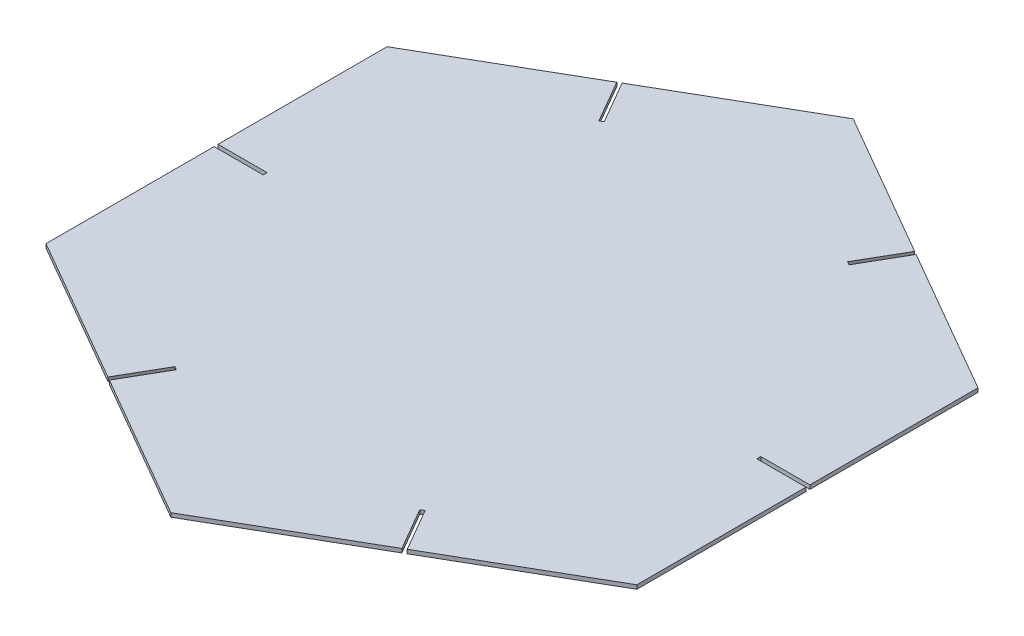
ISO-10303-21;
HEADER;
FILE_DESCRIPTION(('STEP AP214'),'2;1');
FILE_NAME('part.step','',(''),(''),'','','');
FILE_SCHEMA(('AUTOMOTIVE_DESIGN { 1 0 10303 214 1 1 1 1 }'));
ENDSEC;
DATA;
#1=APPLICATION_CONTEXT('core data for automotive mechanical design processes');
#2=APPLICATION_PROTOCOL_DEFINITION('international standard','automotive_design',2000,#1);
#3=PRODUCT_CONTEXT('',#1,'mechanical');
#4=PRODUCT('Part','Part','',(#3));
#5=PRODUCT_RELATED_PRODUCT_CATEGORY('part','',(#4));
#6=PRODUCT_DEFINITION_FORMATION('','',#4);
#7=PRODUCT_DEFINITION_CONTEXT('part definition',#1,'design');
#8=PRODUCT_DEFINITION('design','',#6,#7);
#9=PRODUCT_DEFINITION_SHAPE('','',#8);
#10=(LENGTH_UNIT() NAMED_UNIT(*) SI_UNIT(.MILLI.,.METRE.));
#11=(NAMED_UNIT(*) PLANE_ANGLE_UNIT() SI_UNIT($,.RADIAN.));
#12=(NAMED_UNIT(*) SI_UNIT($,.STERADIAN.) SOLID_ANGLE_UNIT());
#13=UNCERTAINTY_MEASURE_WITH_UNIT(LENGTH_MEASURE(1.E-05),#10,'distance_accuracy_value','');
#14=(GEOMETRIC_REPRESENTATION_CONTEXT(3) GLOBAL_UNCERTAINTY_ASSIGNED_CONTEXT((#13)) GLOBAL_UNIT_ASSIGNED_CONTEXT((#10,
#11,#12)) REPRESENTATION_CONTEXT('',''));
#15=CARTESIAN_POINT('',(0.,0.,0.));
#16=DIRECTION('',(0.,0.,1.));
#17=DIRECTION('',(1.,0.,0.));
#18=AXIS2_PLACEMENT_3D('',#15,#16,#17);
#19=CARTESIAN_POINT('',(60.1955721887819,0.8,-34.7539298072177));
#20=DIRECTION('',(-0.499999999999995,0.,0.866025403784442));
#21=DIRECTION('',(0.866025403784442,0.,0.499999999999995));
#22=AXIS2_PLACEMENT_3D('',#19,#20,#21);
#23=PLANE('',#22);
#24=DIRECTION('',(-0.866025403784442,0.,-0.499999999999995));
#25=VECTOR('',#24,1.);
#26=CARTESIAN_POINT('',(60.1955721887819,0.8,-34.7539298072177));
#27=LINE('',#26,#25);
#28=CARTESIAN_POINT('',(29.6647733924987,0.8,-52.3808947108252));
#29=VERTEX_POINT('',#28);
#30=CARTESIAN_POINT('',(0.,0.8,-69.507859614434));
#31=VERTEX_POINT('',#30);
#32=EDGE_CURVE('E312',#29,#31,#27,.T.);
#33=ORIENTED_EDGE('',*,*,#32,.F.);
#34=DIRECTION('',(0.,-1.,0.));
#35=VECTOR('',#34,1.);
#36=CARTESIAN_POINT('',(29.6647733924987,0.8,-52.3808947108252));
#37=LINE('',#36,#35);
#38=CARTESIAN_POINT('',(29.6647733924987,0.,-52.3808947108252));
#39=VERTEX_POINT('',#38);
#40=EDGE_CURVE('E479',#29,#39,#37,.T.);
#41=ORIENTED_EDGE('',*,*,#40,.T.);
#42=DIRECTION('',(-0.866025403784442,0.,-0.499999999999995));
#43=VECTOR('',#42,1.);
#44=CARTESIAN_POINT('',(60.1955721887819,0.,-34.7539298072177));
#45=LINE('',#44,#43);
#46=CARTESIAN_POINT('',(0.,0.,-69.507859614434));
#47=VERTEX_POINT('',#46);
#48=EDGE_CURVE('E290',#39,#47,#45,.T.);
#49=ORIENTED_EDGE('',*,*,#48,.T.);
#50=DIRECTION('',(0.,-1.,0.));
#51=VECTOR('',#50,1.);
#52=CARTESIAN_POINT('',(0.,0.8,-69.507859614434));
#53=LINE('',#52,#51);
#54=EDGE_CURVE('E11',#31,#47,#53,.T.);
#55=ORIENTED_EDGE('',*,*,#54,.F.);
#56=EDGE_LOOP('',(#33,#41,#49,#55));
#57=FACE_BOUND('',#56,.T.);
#58=ADVANCED_FACE('F41',(#57),#23,.F.);
#59=CARTESIAN_POINT('',(0.,0.8,-69.507859614434));
#60=DIRECTION('',(0.500000000000001,0.,0.866025403784438));
#61=DIRECTION('',(0.866025403784438,0.,-0.500000000000001));
#62=AXIS2_PLACEMENT_3D('',#59,#60,#61);
#63=PLANE('',#62);
#64=DIRECTION('',(-0.866025403784438,0.,0.500000000000001));
#65=VECTOR('',#64,1.);
#66=CARTESIAN_POINT('',(0.,0.8,-69.507859614434));
#67=LINE('',#66,#65);
#68=CARTESIAN_POINT('',(-30.5307987962831,0.8,-51.8808947108252));
#69=VERTEX_POINT('',#68);
#70=CARTESIAN_POINT('',(-60.1955721887824,0.8,-34.7539298072169));
#71=VERTEX_POINT('',#70);
#72=EDGE_CURVE('E410',#69,#71,#67,.T.);
#73=ORIENTED_EDGE('',*,*,#72,.F.);
#74=DIRECTION('',(0.,-1.,0.));
#75=VECTOR('',#74,1.);
#76=CARTESIAN_POINT('',(-30.5307987962831,0.8,-51.8808947108252));
#77=LINE('',#76,#75);
#78=CARTESIAN_POINT('',(-30.5307987962831,0.,-51.8808947108252));
#79=VERTEX_POINT('',#78);
#80=EDGE_CURVE('E473',#69,#79,#77,.T.);
#81=ORIENTED_EDGE('',*,*,#80,.T.);
#82=DIRECTION('',(-0.866025403784438,0.,0.500000000000001));
#83=VECTOR('',#82,1.);
#84=CARTESIAN_POINT('',(0.,0.,-69.507859614434));
#85=LINE('',#84,#83);
#86=CARTESIAN_POINT('',(-60.1955721887824,0.,-34.7539298072169));
#87=VERTEX_POINT('',#86);
#88=EDGE_CURVE('E289',#79,#87,#85,.T.);
#89=ORIENTED_EDGE('',*,*,#88,.T.);
#90=DIRECTION('',(0.,-1.,0.));
#91=VECTOR('',#90,1.);
#92=CARTESIAN_POINT('',(-60.1955721887824,0.8,-34.7539298072169));
#93=LINE('',#92,#91);
#94=EDGE_CURVE('E50',#71,#87,#93,.T.);
#95=ORIENTED_EDGE('',*,*,#94,.F.);
#96=EDGE_LOOP('',(#73,#81,#89,#95));
#97=FACE_BOUND('',#96,.T.);
#98=ADVANCED_FACE('F627',(#97),#63,.F.);
#99=CARTESIAN_POINT('',(-60.1955721887824,0.8,-34.7539298072169));
#100=DIRECTION('',(1.,0.,0.));
#101=DIRECTION('',(0.,0.,-1.));
#102=AXIS2_PLACEMENT_3D('',#99,#100,#101);
#103=PLANE('',#102);
#104=DIRECTION('',(0.,0.,1.));
#105=VECTOR('',#104,1.);
#106=CARTESIAN_POINT('',(-60.1955721887824,0.8,-34.7539298072169));
#107=LINE('',#106,#105);
#108=CARTESIAN_POINT('',(-60.1955721887819,0.8,0.499999999999985));
#109=VERTEX_POINT('',#108);
#110=CARTESIAN_POINT('',(-60.1955721887821,0.8,34.7539298072173));
#111=VERTEX_POINT('',#110);
#112=EDGE_CURVE('E415',#109,#111,#107,.T.);
#113=ORIENTED_EDGE('',*,*,#112,.F.);
#114=DIRECTION('',(0.,-1.,0.));
#115=VECTOR('',#114,1.);
#116=CARTESIAN_POINT('',(-60.1955721887819,0.8,0.499999999999985));
#117=LINE('',#116,#115);
#118=CARTESIAN_POINT('',(-60.1955721887819,0.,0.499999999999985));
#119=VERTEX_POINT('',#118);
#120=EDGE_CURVE('E361',#109,#119,#117,.T.);
#121=ORIENTED_EDGE('',*,*,#120,.T.);
#122=DIRECTION('',(0.,0.,1.));
#123=VECTOR('',#122,1.);
#124=CARTESIAN_POINT('',(-60.1955721887824,0.,-34.7539298072169));
#125=LINE('',#124,#123);
#126=CARTESIAN_POINT('',(-60.1955721887821,0.,34.7539298072173));
#127=VERTEX_POINT('',#126);
#128=EDGE_CURVE('E295',#119,#127,#125,.T.);
#129=ORIENTED_EDGE('',*,*,#128,.T.);
#130=DIRECTION('',(0.,-1.,0.));
#131=VECTOR('',#130,1.);
#132=CARTESIAN_POINT('',(-60.1955721887821,0.8,34.7539298072173));
#133=LINE('',#132,#131);
#134=EDGE_CURVE('E320',#111,#127,#133,.T.);
#135=ORIENTED_EDGE('',*,*,#134,.F.);
#136=EDGE_LOOP('',(#113,#121,#129,#135));
#137=FACE_BOUND('',#136,.T.);
#138=ADVANCED_FACE('F537',(#137),#103,.F.);
#139=CARTESIAN_POINT('',(-60.1955721887821,0.8,34.7539298072173));
#140=DIRECTION('',(0.499999999999995,0.,-0.866025403784442));
#141=DIRECTION('',(-0.866025403784442,0.,-0.499999999999995));
#142=AXIS2_PLACEMENT_3D('',#139,#140,#141);
#143=PLANE('',#142);
#144=DIRECTION('',(0.866025403784442,0.,0.499999999999995));
#145=VECTOR('',#144,1.);
#146=CARTESIAN_POINT('',(-60.1955721887821,0.8,34.7539298072173));
#147=LINE('',#146,#145);
#148=CARTESIAN_POINT('',(-29.6647733924988,0.8,52.3808947108251));
#149=VERTEX_POINT('',#148);
#150=CARTESIAN_POINT('',(4.85370789493449E-13,0.8,69.507859614434));
#151=VERTEX_POINT('',#150);
#152=EDGE_CURVE('E417',#149,#151,#147,.T.);
#153=ORIENTED_EDGE('',*,*,#152,.F.);
#154=DIRECTION('',(0.,-1.,0.));
#155=VECTOR('',#154,1.);
#156=CARTESIAN_POINT('',(-29.6647733924988,0.8,52.3808947108251));
#157=LINE('',#156,#155);
#158=CARTESIAN_POINT('',(-29.6647733924988,0.,52.3808947108251));
#159=VERTEX_POINT('',#158);
#160=EDGE_CURVE('E345',#149,#159,#157,.T.);
#161=ORIENTED_EDGE('',*,*,#160,.T.);
#162=DIRECTION('',(0.866025403784442,0.,0.499999999999995));
#163=VECTOR('',#162,1.);
#164=CARTESIAN_POINT('',(-60.1955721887821,0.,34.7539298072173));
#165=LINE('',#164,#163);
#166=CARTESIAN_POINT('',(4.85370789493449E-13,0.,69.507859614434));
#167=VERTEX_POINT('',#166);
#168=EDGE_CURVE('E300',#159,#167,#165,.T.);
#169=ORIENTED_EDGE('',*,*,#168,.T.);
#170=DIRECTION('',(0.,-1.,0.));
#171=VECTOR('',#170,1.);
#172=CARTESIAN_POINT('',(4.85370789493449E-13,0.8,69.507859614434));
#173=LINE('',#172,#171);
#174=EDGE_CURVE('E316',#151,#167,#173,.T.);
#175=ORIENTED_EDGE('',*,*,#174,.F.);
#176=EDGE_LOOP('',(#153,#161,#169,#175));
#177=FACE_BOUND('',#176,.T.);
#178=ADVANCED_FACE('F431',(#177),#143,.F.);
#179=CARTESIAN_POINT('',(4.85370789493449E-13,0.8,69.507859614434));
#180=DIRECTION('',(-0.500000000000007,0.,-0.866025403784435));
#181=DIRECTION('',(-0.866025403784435,0.,0.500000000000007));
#182=AXIS2_PLACEMENT_3D('',#179,#180,#181);
#183=PLANE('',#182);
#184=DIRECTION('',(0.866025403784435,0.,-0.500000000000007));
#185=VECTOR('',#184,1.);
#186=CARTESIAN_POINT('',(4.85370789493449E-13,0.8,69.507859614434));
#187=LINE('',#186,#185);
#188=CARTESIAN_POINT('',(30.5307987962831,0.8,51.8808947108252));
#189=VERTEX_POINT('',#188);
#190=CARTESIAN_POINT('',(60.1955721887826,0.8,34.7539298072165));
#191=VERTEX_POINT('',#190);
#192=EDGE_CURVE('E270',#189,#191,#187,.T.);
#193=ORIENTED_EDGE('',*,*,#192,.F.);
#194=DIRECTION('',(0.,-1.,0.));
#195=VECTOR('',#194,1.);
#196=CARTESIAN_POINT('',(30.5307987962831,0.8,51.8808947108252));
#197=LINE('',#196,#195);
#198=CARTESIAN_POINT('',(30.5307987962831,0.,51.8808947108252));
#199=VERTEX_POINT('',#198);
#200=EDGE_CURVE('E393',#189,#199,#197,.T.);
#201=ORIENTED_EDGE('',*,*,#200,.T.);
#202=DIRECTION('',(0.866025403784435,0.,-0.500000000000007));
#203=VECTOR('',#202,1.);
#204=CARTESIAN_POINT('',(4.85370789493449E-13,0.,69.507859614434));
#205=LINE('',#204,#203);
#206=CARTESIAN_POINT('',(60.1955721887826,0.,34.7539298072165));
#207=VERTEX_POINT('',#206);
#208=EDGE_CURVE('E305',#199,#207,#205,.T.);
#209=ORIENTED_EDGE('',*,*,#208,.T.);
#210=DIRECTION('',(0.,-1.,0.));
#211=VECTOR('',#210,1.);
#212=CARTESIAN_POINT('',(60.1955721887826,0.8,34.7539298072165));
#213=LINE('',#212,#211);
#214=EDGE_CURVE('E279',#191,#207,#213,.T.);
#215=ORIENTED_EDGE('',*,*,#214,.F.);
#216=EDGE_LOOP('',(#193,#201,#209,#215));
#217=FACE_BOUND('',#216,.T.);
#218=ADVANCED_FACE('F600',(#217),#183,.F.);
#219=CARTESIAN_POINT('',(60.1955721887826,0.8,34.7539298072165));
#220=DIRECTION('',(-1.,0.,0.));
#221=DIRECTION('',(0.,0.,1.));
#222=AXIS2_PLACEMENT_3D('',#219,#220,#221);
#223=PLANE('',#222);
#224=DIRECTION('',(0.,0.,-1.));
#225=VECTOR('',#224,1.);
#226=CARTESIAN_POINT('',(60.1955721887826,0.8,34.7539298072165));
#227=LINE('',#226,#225);
#228=CARTESIAN_POINT('',(60.1955721887819,0.8,-0.5));
#229=VERTEX_POINT('',#228);
#230=CARTESIAN_POINT('',(60.1955721887819,0.8,-34.7539298072177));
#231=VERTEX_POINT('',#230);
#232=EDGE_CURVE('E274',#229,#231,#227,.T.);
#233=ORIENTED_EDGE('',*,*,#232,.F.);
#234=DIRECTION('',(0.,-1.,0.));
#235=VECTOR('',#234,1.);
#236=CARTESIAN_POINT('',(60.1955721887819,0.8,-0.5));
#237=LINE('',#236,#235);
#238=CARTESIAN_POINT('',(60.1955721887819,0.,-0.5));
#239=VERTEX_POINT('',#238);
#240=EDGE_CURVE('E549',#229,#239,#237,.T.);
#241=ORIENTED_EDGE('',*,*,#240,.T.);
#242=DIRECTION('',(0.,0.,-1.));
#243=VECTOR('',#242,1.);
#244=CARTESIAN_POINT('',(60.1955721887826,0.,34.7539298072165));
#245=LINE('',#244,#243);
#246=CARTESIAN_POINT('',(60.1955721887819,0.,-34.7539298072177));
#247=VERTEX_POINT('',#246);
#248=EDGE_CURVE('E310',#239,#247,#245,.T.);
#249=ORIENTED_EDGE('',*,*,#248,.T.);
#250=DIRECTION('',(0.,-1.,0.));
#251=VECTOR('',#250,1.);
#252=CARTESIAN_POINT('',(60.1955721887819,0.8,-34.7539298072177));
#253=LINE('',#252,#251);
#254=EDGE_CURVE('E273',#231,#247,#253,.T.);
#255=ORIENTED_EDGE('',*,*,#254,.F.);
#256=EDGE_LOOP('',(#233,#241,#249,#255));
#257=FACE_BOUND('',#256,.T.);
#258=ADVANCED_FACE('F634',(#257),#223,.F.);
#259=CARTESIAN_POINT('',(30.3575937155266,0.,-51.9808947108257));
#260=VERTEX_POINT('',#259);
#261=EDGE_CURVE('E285',#247,#260,#45,.T.);
#262=ORIENTED_EDGE('',*,*,#261,.T.);
#263=DIRECTION('',(0.,-1.,0.));
#264=VECTOR('',#263,1.);
#265=CARTESIAN_POINT('',(30.3575937155263,0.8,-51.9808947108252));
#266=LINE('',#265,#264);
#267=CARTESIAN_POINT('',(30.3575937155263,0.8,-51.9808947108252));
#268=VERTEX_POINT('',#267);
#269=EDGE_CURVE('E467',#268,#260,#266,.T.);
#270=ORIENTED_EDGE('',*,*,#269,.F.);
#271=EDGE_CURVE('E406',#231,#268,#27,.T.);
#272=ORIENTED_EDGE('',*,*,#271,.F.);
#273=ORIENTED_EDGE('',*,*,#254,.T.);
#274=EDGE_LOOP('',(#262,#270,#272,#273));
#275=FACE_BOUND('',#274,.T.);
#276=ADVANCED_FACE('F43',(#275),#23,.F.);
#277=CARTESIAN_POINT('',(-29.8379784732558,0.,-52.2808947108255));
#278=VERTEX_POINT('',#277);
#279=EDGE_CURVE('E291',#47,#278,#85,.T.);
#280=ORIENTED_EDGE('',*,*,#279,.T.);
#281=DIRECTION('',(0.,-1.,0.));
#282=VECTOR('',#281,1.);
#283=CARTESIAN_POINT('',(-29.8379784732556,0.8,-52.2808947108252));
#284=LINE('',#283,#282);
#285=CARTESIAN_POINT('',(-29.8379784732556,0.8,-52.2808947108252));
#286=VERTEX_POINT('',#285);
#287=EDGE_CURVE('E57',#286,#278,#284,.T.);
#288=ORIENTED_EDGE('',*,*,#287,.F.);
#289=EDGE_CURVE('E411',#31,#286,#67,.T.);
#290=ORIENTED_EDGE('',*,*,#289,.F.);
#291=ORIENTED_EDGE('',*,*,#54,.T.);
#292=EDGE_LOOP('',(#280,#288,#290,#291));
#293=FACE_BOUND('',#292,.T.);
#294=ADVANCED_FACE('F623',(#293),#63,.F.);
#295=CARTESIAN_POINT('',(-60.1955721887823,0.,-0.300000000000016));
#296=VERTEX_POINT('',#295);
#297=EDGE_CURVE('E296',#87,#296,#125,.T.);
#298=ORIENTED_EDGE('',*,*,#297,.T.);
#299=DIRECTION('',(0.,-1.,0.));
#300=VECTOR('',#299,1.);
#301=CARTESIAN_POINT('',(-60.1955721887819,0.8,-0.300000000000015));
#302=LINE('',#301,#300);
#303=CARTESIAN_POINT('',(-60.1955721887819,0.8,-0.300000000000015));
#304=VERTEX_POINT('',#303);
#305=EDGE_CURVE('E65',#304,#296,#302,.T.);
#306=ORIENTED_EDGE('',*,*,#305,.F.);
#307=EDGE_CURVE('E331',#71,#304,#107,.T.);
#308=ORIENTED_EDGE('',*,*,#307,.F.);
#309=ORIENTED_EDGE('',*,*,#94,.T.);
#310=EDGE_LOOP('',(#298,#306,#308,#309));
#311=FACE_BOUND('',#310,.T.);
#312=ADVANCED_FACE('F329',(#311),#103,.F.);
#313=CARTESIAN_POINT('',(-30.3575937155265,0.,51.9808947108255));
#314=VERTEX_POINT('',#313);
#315=EDGE_CURVE('E301',#127,#314,#165,.T.);
#316=ORIENTED_EDGE('',*,*,#315,.T.);
#317=DIRECTION('',(0.,-1.,0.));
#318=VECTOR('',#317,1.);
#319=CARTESIAN_POINT('',(-30.3575937155263,0.8,51.9808947108251));
#320=LINE('',#319,#318);
#321=CARTESIAN_POINT('',(-30.3575937155263,0.8,51.9808947108251));
#322=VERTEX_POINT('',#321);
#323=EDGE_CURVE('E387',#322,#314,#320,.T.);
#324=ORIENTED_EDGE('',*,*,#323,.F.);
#325=EDGE_CURVE('E418',#111,#322,#147,.T.);
#326=ORIENTED_EDGE('',*,*,#325,.F.);
#327=ORIENTED_EDGE('',*,*,#134,.T.);
#328=EDGE_LOOP('',(#316,#324,#326,#327));
#329=FACE_BOUND('',#328,.T.);
#330=ADVANCED_FACE('F615',(#329),#143,.F.);
#331=CARTESIAN_POINT('',(29.8379784732558,0.,52.2808947108255));
#332=VERTEX_POINT('',#331);
#333=EDGE_CURVE('E306',#167,#332,#205,.T.);
#334=ORIENTED_EDGE('',*,*,#333,.T.);
#335=DIRECTION('',(0.,-1.,0.));
#336=VECTOR('',#335,1.);
#337=CARTESIAN_POINT('',(29.8379784732556,0.8,52.2808947108252));
#338=LINE('',#337,#336);
#339=CARTESIAN_POINT('',(29.8379784732556,0.8,52.2808947108252));
#340=VERTEX_POINT('',#339);
#341=EDGE_CURVE('E437',#340,#332,#338,.T.);
#342=ORIENTED_EDGE('',*,*,#341,.F.);
#343=EDGE_CURVE('E281',#151,#340,#187,.T.);
#344=ORIENTED_EDGE('',*,*,#343,.F.);
#345=ORIENTED_EDGE('',*,*,#174,.T.);
#346=EDGE_LOOP('',(#334,#342,#344,#345));
#347=FACE_BOUND('',#346,.T.);
#348=ADVANCED_FACE('F436',(#347),#183,.F.);
#349=CARTESIAN_POINT('',(60.1955721887823,0.,0.300000000000002));
#350=VERTEX_POINT('',#349);
#351=EDGE_CURVE('E262',#207,#350,#245,.T.);
#352=ORIENTED_EDGE('',*,*,#351,.T.);
#353=DIRECTION('',(0.,-1.,0.));
#354=VECTOR('',#353,1.);
#355=CARTESIAN_POINT('',(60.1955721887819,0.8,0.3));
#356=LINE('',#355,#354);
#357=CARTESIAN_POINT('',(60.1955721887819,0.8,0.3));
#358=VERTEX_POINT('',#357);
#359=EDGE_CURVE('E244',#358,#350,#356,.T.);
#360=ORIENTED_EDGE('',*,*,#359,.F.);
#361=EDGE_CURVE('E260',#191,#358,#227,.T.);
#362=ORIENTED_EDGE('',*,*,#361,.F.);
#363=ORIENTED_EDGE('',*,*,#214,.T.);
#364=EDGE_LOOP('',(#352,#360,#362,#363));
#365=FACE_BOUND('',#364,.T.);
#366=ADVANCED_FACE('F258',(#365),#223,.F.);
#367=CARTESIAN_POINT('',(0.,0.8,0.));
#368=DIRECTION('',(0.,1.,0.));
#369=DIRECTION('',(0.,0.,1.));
#370=AXIS2_PLACEMENT_3D('',#367,#368,#369);
#371=PLANE('',#370);
#372=DIRECTION('',(1.,0.,0.));
#373=VECTOR('',#372,1.);
#374=CARTESIAN_POINT('',(60.1955721887819,0.8,-0.5));
#375=LINE('',#374,#373);
#376=CARTESIAN_POINT('',(50.1955721887819,0.8,-0.500000000000001));
#377=VERTEX_POINT('',#376);
#378=EDGE_CURVE('E264',#377,#229,#375,.T.);
#379=ORIENTED_EDGE('',*,*,#378,.T.);
#380=ORIENTED_EDGE('',*,*,#232,.T.);
#381=ORIENTED_EDGE('',*,*,#271,.T.);
#382=DIRECTION('',(-0.5,0.,0.866025403784439));
#383=VECTOR('',#382,1.);
#384=CARTESIAN_POINT('',(30.3575937155263,0.8,-51.9808947108252));
#385=LINE('',#384,#383);
#386=CARTESIAN_POINT('',(25.3575937155263,0.8,-43.3206406729808));
#387=VERTEX_POINT('',#386);
#388=EDGE_CURVE('E454',#268,#387,#385,.T.);
#389=ORIENTED_EDGE('',*,*,#388,.T.);
#390=DIRECTION('',(-0.86602540378444,0.,-0.499999999999999));
#391=VECTOR('',#390,1.);
#392=CARTESIAN_POINT('',(24.6647733924987,0.8,-43.7206406729808));
#393=LINE('',#392,#391);
#394=CARTESIAN_POINT('',(24.6647733924987,0.8,-43.7206406729808));
#395=VERTEX_POINT('',#394);
#396=EDGE_CURVE('E458',#387,#395,#393,.T.);
#397=ORIENTED_EDGE('',*,*,#396,.T.);
#398=DIRECTION('',(0.5,0.,-0.866025403784439));
#399=VECTOR('',#398,1.);
#400=CARTESIAN_POINT('',(29.6647733924987,0.8,-52.3808947108252));
#401=LINE('',#400,#399);
#402=EDGE_CURVE('E463',#395,#29,#401,.T.);
#403=ORIENTED_EDGE('',*,*,#402,.T.);
#404=ORIENTED_EDGE('',*,*,#32,.T.);
#405=ORIENTED_EDGE('',*,*,#289,.T.);
#406=DIRECTION('',(0.499999999999999,0.,0.866025403784439));
#407=VECTOR('',#406,1.);
#408=CARTESIAN_POINT('',(-29.8379784732556,0.8,-52.2808947108252));
#409=LINE('',#408,#407);
#410=CARTESIAN_POINT('',(-24.8379784732556,0.8,-43.6206406729808));
#411=VERTEX_POINT('',#410);
#412=EDGE_CURVE('E492',#286,#411,#409,.T.);
#413=ORIENTED_EDGE('',*,*,#412,.T.);
#414=DIRECTION('',(-0.866025403784437,0.,0.500000000000002));
#415=VECTOR('',#414,1.);
#416=CARTESIAN_POINT('',(-25.5307987962831,0.8,-43.2206406729808));
#417=LINE('',#416,#415);
#418=CARTESIAN_POINT('',(-25.5307987962831,0.8,-43.2206406729808));
#419=VERTEX_POINT('',#418);
#420=EDGE_CURVE('E496',#411,#419,#417,.T.);
#421=ORIENTED_EDGE('',*,*,#420,.T.);
#422=DIRECTION('',(-0.5,0.,-0.866025403784439));
#423=VECTOR('',#422,1.);
#424=CARTESIAN_POINT('',(-30.5307987962831,0.8,-51.8808947108252));
#425=LINE('',#424,#423);
#426=EDGE_CURVE('E501',#419,#69,#425,.T.);
#427=ORIENTED_EDGE('',*,*,#426,.T.);
#428=ORIENTED_EDGE('',*,*,#72,.T.);
#429=ORIENTED_EDGE('',*,*,#307,.T.);
#430=DIRECTION('',(1.,0.,0.));
#431=VECTOR('',#430,1.);
#432=CARTESIAN_POINT('',(-60.1955721887819,0.8,-0.300000000000015));
#433=LINE('',#432,#431);
#434=CARTESIAN_POINT('',(-50.1955721887819,0.8,-0.300000000000013));
#435=VERTEX_POINT('',#434);
#436=EDGE_CURVE('E360',#304,#435,#433,.T.);
#437=ORIENTED_EDGE('',*,*,#436,.T.);
#438=DIRECTION('',(0.,0.,1.));
#439=VECTOR('',#438,1.);
#440=CARTESIAN_POINT('',(-50.1955721887819,0.8,0.499999999999987));
#441=LINE('',#440,#439);
#442=CARTESIAN_POINT('',(-50.1955721887819,0.8,0.499999999999987));
#443=VERTEX_POINT('',#442);
#444=EDGE_CURVE('E526',#435,#443,#441,.T.);
#445=ORIENTED_EDGE('',*,*,#444,.T.);
#446=DIRECTION('',(-1.,0.,0.));
#447=VECTOR('',#446,1.);
#448=CARTESIAN_POINT('',(-60.1955721887819,0.8,0.499999999999985));
#449=LINE('',#448,#447);
#450=EDGE_CURVE('E355',#443,#109,#449,.T.);
#451=ORIENTED_EDGE('',*,*,#450,.T.);
#452=ORIENTED_EDGE('',*,*,#112,.T.);
#453=ORIENTED_EDGE('',*,*,#325,.T.);
#454=DIRECTION('',(0.500000000000001,0.,-0.866025403784438));
#455=VECTOR('',#454,1.);
#456=CARTESIAN_POINT('',(-30.3575937155263,0.8,51.9808947108251));
#457=LINE('',#456,#455);
#458=CARTESIAN_POINT('',(-25.3575937155263,0.8,43.3206406729808));
#459=VERTEX_POINT('',#458);
#460=EDGE_CURVE('E374',#322,#459,#457,.T.);
#461=ORIENTED_EDGE('',*,*,#460,.T.);
#462=DIRECTION('',(0.866025403784438,0.,0.5));
#463=VECTOR('',#462,1.);
#464=CARTESIAN_POINT('',(-24.6647733924988,0.8,43.7206406729808));
#465=LINE('',#464,#463);
#466=CARTESIAN_POINT('',(-24.6647733924988,0.8,43.7206406729808));
#467=VERTEX_POINT('',#466);
#468=EDGE_CURVE('E378',#459,#467,#465,.T.);
#469=ORIENTED_EDGE('',*,*,#468,.T.);
#470=DIRECTION('',(-0.5,0.,0.866025403784439));
#471=VECTOR('',#470,1.);
#472=CARTESIAN_POINT('',(-29.6647733924988,0.8,52.3808947108251));
#473=LINE('',#472,#471);
#474=EDGE_CURVE('E383',#467,#149,#473,.T.);
#475=ORIENTED_EDGE('',*,*,#474,.T.);
#476=ORIENTED_EDGE('',*,*,#152,.T.);
#477=ORIENTED_EDGE('',*,*,#343,.T.);
#478=DIRECTION('',(-0.499999999999999,0.,-0.866025403784439));
#479=VECTOR('',#478,1.);
#480=CARTESIAN_POINT('',(29.8379784732556,0.8,52.2808947108252));
#481=LINE('',#480,#479);
#482=CARTESIAN_POINT('',(24.8379784732556,0.8,43.6206406729808));
#483=VERTEX_POINT('',#482);
#484=EDGE_CURVE('E571',#340,#483,#481,.T.);
#485=ORIENTED_EDGE('',*,*,#484,.T.);
#486=DIRECTION('',(0.86602540378444,0.,-0.499999999999999));
#487=VECTOR('',#486,1.);
#488=CARTESIAN_POINT('',(25.5307987962831,0.8,43.2206406729808));
#489=LINE('',#488,#487);
#490=CARTESIAN_POINT('',(25.5307987962831,0.8,43.2206406729808));
#491=VERTEX_POINT('',#490);
#492=EDGE_CURVE('E450',#483,#491,#489,.T.);
#493=ORIENTED_EDGE('',*,*,#492,.T.);
#494=DIRECTION('',(0.5,0.,0.866025403784439));
#495=VECTOR('',#494,1.);
#496=CARTESIAN_POINT('',(30.5307987962831,0.8,51.8808947108252));
#497=LINE('',#496,#495);
#498=EDGE_CURVE('E444',#491,#189,#497,.T.);
#499=ORIENTED_EDGE('',*,*,#498,.T.);
#500=ORIENTED_EDGE('',*,*,#192,.T.);
#501=ORIENTED_EDGE('',*,*,#361,.T.);
#502=DIRECTION('',(-1.,0.,0.));
#503=VECTOR('',#502,1.);
#504=CARTESIAN_POINT('',(60.1955721887819,0.8,0.3));
#505=LINE('',#504,#503);
#506=CARTESIAN_POINT('',(50.1955721887819,0.8,0.299999999999999));
#507=VERTEX_POINT('',#506);
#508=EDGE_CURVE('E240',#358,#507,#505,.T.);
#509=ORIENTED_EDGE('',*,*,#508,.T.);
#510=DIRECTION('',(0.,0.,-1.));
#511=VECTOR('',#510,1.);
#512=CARTESIAN_POINT('',(50.1955721887819,0.8,-0.500000000000001));
#513=LINE('',#512,#511);
#514=EDGE_CURVE('E252',#507,#377,#513,.T.);
#515=ORIENTED_EDGE('',*,*,#514,.T.);
#516=EDGE_LOOP('',(#379,#380,#381,#389,#397,#403,#404,#405,#413,#421,#427,#428,#429,#437,#445,
#451,#452,#453,#461,#469,#475,#476,#477,#485,#493,#499,#500,#501,#509,#515));
#517=FACE_BOUND('',#516,.T.);
#518=ADVANCED_FACE('F267',(#517),#371,.T.);
#519=CARTESIAN_POINT('',(0.,0.,0.));
#520=DIRECTION('',(0.,1.,0.));
#521=DIRECTION('',(0.,0.,1.));
#522=AXIS2_PLACEMENT_3D('',#519,#520,#521);
#523=PLANE('',#522);
#524=ORIENTED_EDGE('',*,*,#248,.F.);
#525=DIRECTION('',(1.,0.,0.));
#526=VECTOR('',#525,1.);
#527=CARTESIAN_POINT('',(60.1955721887819,0.,-0.5));
#528=LINE('',#527,#526);
#529=CARTESIAN_POINT('',(50.1955721887819,0.,-0.500000000000001));
#530=VERTEX_POINT('',#529);
#531=EDGE_CURVE('E253',#530,#239,#528,.T.);
#532=ORIENTED_EDGE('',*,*,#531,.F.);
#533=DIRECTION('',(0.,0.,-1.));
#534=VECTOR('',#533,1.);
#535=CARTESIAN_POINT('',(50.1955721887819,0.,-0.500000000000001));
#536=LINE('',#535,#534);
#537=CARTESIAN_POINT('',(50.1955721887819,0.,0.299999999999999));
#538=VERTEX_POINT('',#537);
#539=EDGE_CURVE('E563',#538,#530,#536,.T.);
#540=ORIENTED_EDGE('',*,*,#539,.F.);
#541=DIRECTION('',(-1.,0.,0.));
#542=VECTOR('',#541,1.);
#543=CARTESIAN_POINT('',(60.1955721887819,0.,0.3));
#544=LINE('',#543,#542);
#545=EDGE_CURVE('E483',#350,#538,#544,.T.);
#546=ORIENTED_EDGE('',*,*,#545,.F.);
#547=ORIENTED_EDGE('',*,*,#351,.F.);
#548=ORIENTED_EDGE('',*,*,#208,.F.);
#549=DIRECTION('',(0.5,0.,0.866025403784439));
#550=VECTOR('',#549,1.);
#551=CARTESIAN_POINT('',(30.5307987962831,0.,51.8808947108252));
#552=LINE('',#551,#550);
#553=CARTESIAN_POINT('',(25.5307987962831,0.,43.2206406729808));
#554=VERTEX_POINT('',#553);
#555=EDGE_CURVE('E574',#554,#199,#552,.T.);
#556=ORIENTED_EDGE('',*,*,#555,.F.);
#557=DIRECTION('',(0.86602540378444,0.,-0.499999999999999));
#558=VECTOR('',#557,1.);
#559=CARTESIAN_POINT('',(25.5307987962831,0.,43.2206406729808));
#560=LINE('',#559,#558);
#561=CARTESIAN_POINT('',(24.8379784732556,0.,43.6206406729808));
#562=VERTEX_POINT('',#561);
#563=EDGE_CURVE('E581',#562,#554,#560,.T.);
#564=ORIENTED_EDGE('',*,*,#563,.F.);
#565=DIRECTION('',(-0.499999999999999,0.,-0.866025403784439));
#566=VECTOR('',#565,1.);
#567=CARTESIAN_POINT('',(29.8379784732556,0.,52.2808947108252));
#568=LINE('',#567,#566);
#569=EDGE_CURVE('E578',#332,#562,#568,.T.);
#570=ORIENTED_EDGE('',*,*,#569,.F.);
#571=ORIENTED_EDGE('',*,*,#333,.F.);
#572=ORIENTED_EDGE('',*,*,#168,.F.);
#573=DIRECTION('',(-0.5,0.,0.866025403784439));
#574=VECTOR('',#573,1.);
#575=CARTESIAN_POINT('',(-29.6647733924988,0.,52.3808947108251));
#576=LINE('',#575,#574);
#577=CARTESIAN_POINT('',(-24.6647733924988,0.,43.7206406729808));
#578=VERTEX_POINT('',#577);
#579=EDGE_CURVE('E379',#578,#159,#576,.T.);
#580=ORIENTED_EDGE('',*,*,#579,.F.);
#581=DIRECTION('',(0.866025403784438,0.,0.5));
#582=VECTOR('',#581,1.);
#583=CARTESIAN_POINT('',(-24.6647733924988,0.,43.7206406729808));
#584=LINE('',#583,#582);
#585=CARTESIAN_POINT('',(-25.3575937155263,0.,43.3206406729808));
#586=VERTEX_POINT('',#585);
#587=EDGE_CURVE('E392',#586,#578,#584,.T.);
#588=ORIENTED_EDGE('',*,*,#587,.F.);
#589=DIRECTION('',(0.500000000000001,0.,-0.866025403784438));
#590=VECTOR('',#589,1.);
#591=CARTESIAN_POINT('',(-30.3575937155263,0.,51.9808947108251));
#592=LINE('',#591,#590);
#593=EDGE_CURVE('E388',#314,#586,#592,.T.);
#594=ORIENTED_EDGE('',*,*,#593,.F.);
#595=ORIENTED_EDGE('',*,*,#315,.F.);
#596=ORIENTED_EDGE('',*,*,#128,.F.);
#597=DIRECTION('',(-1.,0.,0.));
#598=VECTOR('',#597,1.);
#599=CARTESIAN_POINT('',(-60.1955721887819,0.,0.499999999999985));
#600=LINE('',#599,#598);
#601=CARTESIAN_POINT('',(-50.1955721887819,0.,0.499999999999987));
#602=VERTEX_POINT('',#601);
#603=EDGE_CURVE('E349',#602,#119,#600,.T.);
#604=ORIENTED_EDGE('',*,*,#603,.F.);
#605=DIRECTION('',(0.,0.,1.));
#606=VECTOR('',#605,1.);
#607=CARTESIAN_POINT('',(-50.1955721887819,0.,0.499999999999987));
#608=LINE('',#607,#606);
#609=CARTESIAN_POINT('',(-50.1955721887819,0.,-0.300000000000013));
#610=VERTEX_POINT('',#609);
#611=EDGE_CURVE('E343',#610,#602,#608,.T.);
#612=ORIENTED_EDGE('',*,*,#611,.F.);
#613=DIRECTION('',(1.,0.,0.));
#614=VECTOR('',#613,1.);
#615=CARTESIAN_POINT('',(-60.1955721887819,0.,-0.300000000000015));
#616=LINE('',#615,#614);
#617=EDGE_CURVE('E340',#296,#610,#616,.T.);
#618=ORIENTED_EDGE('',*,*,#617,.F.);
#619=ORIENTED_EDGE('',*,*,#297,.F.);
#620=ORIENTED_EDGE('',*,*,#88,.F.);
#621=DIRECTION('',(-0.5,0.,-0.866025403784439));
#622=VECTOR('',#621,1.);
#623=CARTESIAN_POINT('',(-30.5307987962831,0.,-51.8808947108252));
#624=LINE('',#623,#622);
#625=CARTESIAN_POINT('',(-25.5307987962831,0.,-43.2206406729808));
#626=VERTEX_POINT('',#625);
#627=EDGE_CURVE('E497',#626,#79,#624,.T.);
#628=ORIENTED_EDGE('',*,*,#627,.F.);
#629=DIRECTION('',(-0.866025403784437,0.,0.500000000000002));
#630=VECTOR('',#629,1.);
#631=CARTESIAN_POINT('',(-25.5307987962831,0.,-43.2206406729808));
#632=LINE('',#631,#630);
#633=CARTESIAN_POINT('',(-24.8379784732556,0.,-43.6206406729808));
#634=VERTEX_POINT('',#633);
#635=EDGE_CURVE('E507',#634,#626,#632,.T.);
#636=ORIENTED_EDGE('',*,*,#635,.F.);
#637=DIRECTION('',(0.499999999999999,0.,0.866025403784439));
#638=VECTOR('',#637,1.);
#639=CARTESIAN_POINT('',(-29.8379784732556,0.,-52.2808947108252));
#640=LINE('',#639,#638);
#641=EDGE_CURVE('E365',#278,#634,#640,.T.);
#642=ORIENTED_EDGE('',*,*,#641,.F.);
#643=ORIENTED_EDGE('',*,*,#279,.F.);
#644=ORIENTED_EDGE('',*,*,#48,.F.);
#645=DIRECTION('',(0.5,0.,-0.866025403784439));
#646=VECTOR('',#645,1.);
#647=CARTESIAN_POINT('',(29.6647733924987,0.,-52.3808947108252));
#648=LINE('',#647,#646);
#649=CARTESIAN_POINT('',(24.6647733924987,0.,-43.7206406729808));
#650=VERTEX_POINT('',#649);
#651=EDGE_CURVE('E459',#650,#39,#648,.T.);
#652=ORIENTED_EDGE('',*,*,#651,.F.);
#653=DIRECTION('',(-0.86602540378444,0.,-0.499999999999999));
#654=VECTOR('',#653,1.);
#655=CARTESIAN_POINT('',(24.6647733924987,0.,-43.7206406729808));
#656=LINE('',#655,#654);
#657=CARTESIAN_POINT('',(25.3575937155263,0.,-43.3206406729808));
#658=VERTEX_POINT('',#657);
#659=EDGE_CURVE('E472',#658,#650,#656,.T.);
#660=ORIENTED_EDGE('',*,*,#659,.F.);
#661=DIRECTION('',(-0.5,0.,0.866025403784439));
#662=VECTOR('',#661,1.);
#663=CARTESIAN_POINT('',(30.3575937155263,0.,-51.9808947108252));
#664=LINE('',#663,#662);
#665=EDGE_CURVE('E468',#260,#658,#664,.T.);
#666=ORIENTED_EDGE('',*,*,#665,.F.);
#667=ORIENTED_EDGE('',*,*,#261,.F.);
#668=EDGE_LOOP('',(#524,#532,#540,#546,#547,#548,#556,#564,#570,#571,#572,#580,#588,#594,#595,
#596,#604,#612,#618,#619,#620,#628,#636,#642,#643,#644,#652,#660,#666,#667));
#669=FACE_BOUND('',#668,.T.);
#670=ADVANCED_FACE('F337',(#669),#523,.F.);
#671=CARTESIAN_POINT('',(29.6647733924987,0.8,-52.3808947108252));
#672=DIRECTION('',(-0.866025403784439,0.,-0.5));
#673=DIRECTION('',(-0.5,0.,0.866025403784439));
#674=AXIS2_PLACEMENT_3D('',#671,#672,#673);
#675=PLANE('',#674);
#676=ORIENTED_EDGE('',*,*,#651,.T.);
#677=ORIENTED_EDGE('',*,*,#40,.F.);
#678=ORIENTED_EDGE('',*,*,#402,.F.);
#679=DIRECTION('',(0.,-1.,0.));
#680=VECTOR('',#679,1.);
#681=CARTESIAN_POINT('',(24.6647733924987,0.8,-43.7206406729808));
#682=LINE('',#681,#680);
#683=EDGE_CURVE('E484',#395,#650,#682,.T.);
#684=ORIENTED_EDGE('',*,*,#683,.T.);
#685=EDGE_LOOP('',(#676,#677,#678,#684));
#686=FACE_BOUND('',#685,.T.);
#687=ADVANCED_FACE('F675',(#686),#675,.F.);
#688=CARTESIAN_POINT('',(24.6647733924987,0.8,-43.7206406729808));
#689=DIRECTION('',(-0.499999999999999,0.,0.866025403784439));
#690=DIRECTION('',(0.866025403784439,0.,0.499999999999999));
#691=AXIS2_PLACEMENT_3D('',#688,#689,#690);
#692=PLANE('',#691);
#693=ORIENTED_EDGE('',*,*,#659,.T.);
#694=ORIENTED_EDGE('',*,*,#683,.F.);
#695=ORIENTED_EDGE('',*,*,#396,.F.);
#696=DIRECTION('',(0.,-1.,0.));
#697=VECTOR('',#696,1.);
#698=CARTESIAN_POINT('',(25.3575937155263,0.8,-43.3206406729808));
#699=LINE('',#698,#697);
#700=EDGE_CURVE('E487',#387,#658,#699,.T.);
#701=ORIENTED_EDGE('',*,*,#700,.T.);
#702=EDGE_LOOP('',(#693,#694,#695,#701));
#703=FACE_BOUND('',#702,.T.);
#704=ADVANCED_FACE('F678',(#703),#692,.F.);
#705=CARTESIAN_POINT('',(30.3575937155263,0.8,-51.9808947108252));
#706=DIRECTION('',(0.866025403784439,0.,0.5));
#707=DIRECTION('',(0.5,0.,-0.866025403784439));
#708=AXIS2_PLACEMENT_3D('',#705,#706,#707);
#709=PLANE('',#708);
#710=ORIENTED_EDGE('',*,*,#665,.T.);
#711=ORIENTED_EDGE('',*,*,#700,.F.);
#712=ORIENTED_EDGE('',*,*,#388,.F.);
#713=ORIENTED_EDGE('',*,*,#269,.T.);
#714=EDGE_LOOP('',(#710,#711,#712,#713));
#715=FACE_BOUND('',#714,.T.);
#716=ADVANCED_FACE('F652',(#715),#709,.F.);
#717=CARTESIAN_POINT('',(-30.5307987962831,0.8,-51.8808947108252));
#718=DIRECTION('',(-0.866025403784439,0.,0.5));
#719=DIRECTION('',(0.5,0.,0.866025403784439));
#720=AXIS2_PLACEMENT_3D('',#717,#718,#719);
#721=PLANE('',#720);
#722=ORIENTED_EDGE('',*,*,#627,.T.);
#723=ORIENTED_EDGE('',*,*,#80,.F.);
#724=ORIENTED_EDGE('',*,*,#426,.F.);
#725=DIRECTION('',(0.,-1.,0.));
#726=VECTOR('',#725,1.);
#727=CARTESIAN_POINT('',(-25.5307987962831,0.8,-43.2206406729808));
#728=LINE('',#727,#726);
#729=EDGE_CURVE('E516',#419,#626,#728,.T.);
#730=ORIENTED_EDGE('',*,*,#729,.T.);
#731=EDGE_LOOP('',(#722,#723,#724,#730));
#732=FACE_BOUND('',#731,.T.);
#733=ADVANCED_FACE('F685',(#732),#721,.F.);
#734=CARTESIAN_POINT('',(-25.5307987962831,0.8,-43.2206406729808));
#735=DIRECTION('',(0.500000000000002,0.,0.866025403784437));
#736=DIRECTION('',(0.866025403784437,0.,-0.500000000000002));
#737=AXIS2_PLACEMENT_3D('',#734,#735,#736);
#738=PLANE('',#737);
#739=ORIENTED_EDGE('',*,*,#635,.T.);
#740=ORIENTED_EDGE('',*,*,#729,.F.);
#741=ORIENTED_EDGE('',*,*,#420,.F.);
#742=DIRECTION('',(0.,-1.,0.));
#743=VECTOR('',#742,1.);
#744=CARTESIAN_POINT('',(-24.8379784732556,0.8,-43.6206406729808));
#745=LINE('',#744,#743);
#746=EDGE_CURVE('E519',#411,#634,#745,.T.);
#747=ORIENTED_EDGE('',*,*,#746,.T.);
#748=EDGE_LOOP('',(#739,#740,#741,#747));
#749=FACE_BOUND('',#748,.T.);
#750=ADVANCED_FACE('F688',(#749),#738,.F.);
#751=CARTESIAN_POINT('',(-29.8379784732556,0.8,-52.2808947108252));
#752=DIRECTION('',(0.866025403784439,0.,-0.499999999999999));
#753=DIRECTION('',(-0.499999999999999,0.,-0.866025403784439));
#754=AXIS2_PLACEMENT_3D('',#751,#752,#753);
#755=PLANE('',#754);
#756=ORIENTED_EDGE('',*,*,#641,.T.);
#757=ORIENTED_EDGE('',*,*,#746,.F.);
#758=ORIENTED_EDGE('',*,*,#412,.F.);
#759=ORIENTED_EDGE('',*,*,#287,.T.);
#760=EDGE_LOOP('',(#756,#757,#758,#759));
#761=FACE_BOUND('',#760,.T.);
#762=ADVANCED_FACE('F692',(#761),#755,.F.);
#763=CARTESIAN_POINT('',(-60.1955721887819,0.8,0.499999999999985));
#764=DIRECTION('',(0.,0.,1.));
#765=DIRECTION('',(1.,0.,0.));
#766=AXIS2_PLACEMENT_3D('',#763,#764,#765);
#767=PLANE('',#766);
#768=ORIENTED_EDGE('',*,*,#603,.T.);
#769=ORIENTED_EDGE('',*,*,#120,.F.);
#770=ORIENTED_EDGE('',*,*,#450,.F.);
#771=DIRECTION('',(0.,-1.,0.));
#772=VECTOR('',#771,1.);
#773=CARTESIAN_POINT('',(-50.1955721887819,0.8,0.499999999999987));
#774=LINE('',#773,#772);
#775=EDGE_CURVE('E366',#443,#602,#774,.T.);
#776=ORIENTED_EDGE('',*,*,#775,.T.);
#777=EDGE_LOOP('',(#768,#769,#770,#776));
#778=FACE_BOUND('',#777,.T.);
#779=ADVANCED_FACE('F696',(#778),#767,.F.);
#780=CARTESIAN_POINT('',(-50.1955721887819,0.8,0.499999999999987));
#781=DIRECTION('',(1.,0.,0.));
#782=DIRECTION('',(0.,0.,-1.));
#783=AXIS2_PLACEMENT_3D('',#780,#781,#782);
#784=PLANE('',#783);
#785=ORIENTED_EDGE('',*,*,#611,.T.);
#786=ORIENTED_EDGE('',*,*,#775,.F.);
#787=ORIENTED_EDGE('',*,*,#444,.F.);
#788=DIRECTION('',(0.,-1.,0.));
#789=VECTOR('',#788,1.);
#790=CARTESIAN_POINT('',(-50.1955721887819,0.8,-0.300000000000013));
#791=LINE('',#790,#789);
#792=EDGE_CURVE('E369',#435,#610,#791,.T.);
#793=ORIENTED_EDGE('',*,*,#792,.T.);
#794=EDGE_LOOP('',(#785,#786,#787,#793));
#795=FACE_BOUND('',#794,.T.);
#796=ADVANCED_FACE('F699',(#795),#784,.F.);
#797=CARTESIAN_POINT('',(-60.1955721887819,0.8,-0.300000000000015));
#798=DIRECTION('',(0.,0.,-1.));
#799=DIRECTION('',(-1.,0.,0.));
#800=AXIS2_PLACEMENT_3D('',#797,#798,#799);
#801=PLANE('',#800);
#802=ORIENTED_EDGE('',*,*,#617,.T.);
#803=ORIENTED_EDGE('',*,*,#792,.F.);
#804=ORIENTED_EDGE('',*,*,#436,.F.);
#805=ORIENTED_EDGE('',*,*,#305,.T.);
#806=EDGE_LOOP('',(#802,#803,#804,#805));
#807=FACE_BOUND('',#806,.T.);
#808=ADVANCED_FACE('F702',(#807),#801,.F.);
#809=CARTESIAN_POINT('',(-29.6647733924988,0.8,52.3808947108251));
#810=DIRECTION('',(0.866025403784439,0.,0.5));
#811=DIRECTION('',(0.5,0.,-0.866025403784439));
#812=AXIS2_PLACEMENT_3D('',#809,#810,#811);
#813=PLANE('',#812);
#814=ORIENTED_EDGE('',*,*,#579,.T.);
#815=ORIENTED_EDGE('',*,*,#160,.F.);
#816=ORIENTED_EDGE('',*,*,#474,.F.);
#817=DIRECTION('',(0.,-1.,0.));
#818=VECTOR('',#817,1.);
#819=CARTESIAN_POINT('',(-24.6647733924988,0.8,43.7206406729808));
#820=LINE('',#819,#818);
#821=EDGE_CURVE('E352',#467,#578,#820,.T.);
#822=ORIENTED_EDGE('',*,*,#821,.T.);
#823=EDGE_LOOP('',(#814,#815,#816,#822));
#824=FACE_BOUND('',#823,.T.);
#825=ADVANCED_FACE('F606',(#824),#813,.F.);
#826=CARTESIAN_POINT('',(-24.6647733924988,0.8,43.7206406729808));
#827=DIRECTION('',(0.5,0.,-0.866025403784438));
#828=DIRECTION('',(-0.866025403784438,0.,-0.5));
#829=AXIS2_PLACEMENT_3D('',#826,#827,#828);
#830=PLANE('',#829);
#831=ORIENTED_EDGE('',*,*,#587,.T.);
#832=ORIENTED_EDGE('',*,*,#821,.F.);
#833=ORIENTED_EDGE('',*,*,#468,.F.);
#834=DIRECTION('',(0.,-1.,0.));
#835=VECTOR('',#834,1.);
#836=CARTESIAN_POINT('',(-25.3575937155263,0.8,43.3206406729808));
#837=LINE('',#836,#835);
#838=EDGE_CURVE('E401',#459,#586,#837,.T.);
#839=ORIENTED_EDGE('',*,*,#838,.T.);
#840=EDGE_LOOP('',(#831,#832,#833,#839));
#841=FACE_BOUND('',#840,.T.);
#842=ADVANCED_FACE('F609',(#841),#830,.F.);
#843=CARTESIAN_POINT('',(-30.3575937155263,0.8,51.9808947108251));
#844=DIRECTION('',(-0.866025403784438,0.,-0.500000000000001));
#845=DIRECTION('',(-0.500000000000001,0.,0.866025403784438));
#846=AXIS2_PLACEMENT_3D('',#843,#844,#845);
#847=PLANE('',#846);
#848=ORIENTED_EDGE('',*,*,#593,.T.);
#849=ORIENTED_EDGE('',*,*,#838,.F.);
#850=ORIENTED_EDGE('',*,*,#460,.F.);
#851=ORIENTED_EDGE('',*,*,#323,.T.);
#852=EDGE_LOOP('',(#848,#849,#850,#851));
#853=FACE_BOUND('',#852,.T.);
#854=ADVANCED_FACE('F611',(#853),#847,.F.);
#855=CARTESIAN_POINT('',(30.5307987962831,0.8,51.8808947108252));
#856=DIRECTION('',(0.866025403784439,0.,-0.5));
#857=DIRECTION('',(-0.5,0.,-0.866025403784439));
#858=AXIS2_PLACEMENT_3D('',#855,#856,#857);
#859=PLANE('',#858);
#860=ORIENTED_EDGE('',*,*,#555,.T.);
#861=ORIENTED_EDGE('',*,*,#200,.F.);
#862=ORIENTED_EDGE('',*,*,#498,.F.);
#863=DIRECTION('',(0.,-1.,0.));
#864=VECTOR('',#863,1.);
#865=CARTESIAN_POINT('',(25.5307987962831,0.8,43.2206406729808));
#866=LINE('',#865,#864);
#867=EDGE_CURVE('E448',#491,#554,#866,.T.);
#868=ORIENTED_EDGE('',*,*,#867,.T.);
#869=EDGE_LOOP('',(#860,#861,#862,#868));
#870=FACE_BOUND('',#869,.T.);
#871=ADVANCED_FACE('F592',(#870),#859,.F.);
#872=CARTESIAN_POINT('',(25.5307987962831,0.8,43.2206406729808));
#873=DIRECTION('',(-0.499999999999999,0.,-0.866025403784439));
#874=DIRECTION('',(-0.866025403784439,0.,0.499999999999999));
#875=AXIS2_PLACEMENT_3D('',#872,#873,#874);
#876=PLANE('',#875);
#877=ORIENTED_EDGE('',*,*,#563,.T.);
#878=ORIENTED_EDGE('',*,*,#867,.F.);
#879=ORIENTED_EDGE('',*,*,#492,.F.);
#880=DIRECTION('',(0.,-1.,0.));
#881=VECTOR('',#880,1.);
#882=CARTESIAN_POINT('',(24.8379784732556,0.8,43.6206406729808));
#883=LINE('',#882,#881);
#884=EDGE_CURVE('E443',#483,#562,#883,.T.);
#885=ORIENTED_EDGE('',*,*,#884,.T.);
#886=EDGE_LOOP('',(#877,#878,#879,#885));
#887=FACE_BOUND('',#886,.T.);
#888=ADVANCED_FACE('F597',(#887),#876,.F.);
#889=CARTESIAN_POINT('',(29.8379784732556,0.8,52.2808947108252));
#890=DIRECTION('',(-0.866025403784439,0.,0.499999999999999));
#891=DIRECTION('',(0.499999999999999,0.,0.866025403784439));
#892=AXIS2_PLACEMENT_3D('',#889,#890,#891);
#893=PLANE('',#892);
#894=ORIENTED_EDGE('',*,*,#569,.T.);
#895=ORIENTED_EDGE('',*,*,#884,.F.);
#896=ORIENTED_EDGE('',*,*,#484,.F.);
#897=ORIENTED_EDGE('',*,*,#341,.T.);
#898=EDGE_LOOP('',(#894,#895,#896,#897));
#899=FACE_BOUND('',#898,.T.);
#900=ADVANCED_FACE('F601',(#899),#893,.F.);
#901=CARTESIAN_POINT('',(60.1955721887819,0.8,-0.5));
#902=DIRECTION('',(0.,0.,-1.));
#903=DIRECTION('',(-1.,0.,0.));
#904=AXIS2_PLACEMENT_3D('',#901,#902,#903);
#905=PLANE('',#904);
#906=ORIENTED_EDGE('',*,*,#531,.T.);
#907=ORIENTED_EDGE('',*,*,#240,.F.);
#908=ORIENTED_EDGE('',*,*,#378,.F.);
#909=DIRECTION('',(0.,-1.,0.));
#910=VECTOR('',#909,1.);
#911=CARTESIAN_POINT('',(50.1955721887819,0.8,-0.500000000000001));
#912=LINE('',#911,#910);
#913=EDGE_CURVE('E552',#377,#530,#912,.T.);
#914=ORIENTED_EDGE('',*,*,#913,.T.);
#915=EDGE_LOOP('',(#906,#907,#908,#914));
#916=FACE_BOUND('',#915,.T.);
#917=ADVANCED_FACE('F657',(#916),#905,.F.);
#918=CARTESIAN_POINT('',(50.1955721887819,0.8,-0.500000000000001));
#919=DIRECTION('',(-1.,0.,0.));
#920=DIRECTION('',(0.,0.,1.));
#921=AXIS2_PLACEMENT_3D('',#918,#919,#920);
#922=PLANE('',#921);
#923=ORIENTED_EDGE('',*,*,#539,.T.);
#924=ORIENTED_EDGE('',*,*,#913,.F.);
#925=ORIENTED_EDGE('',*,*,#514,.F.);
#926=DIRECTION('',(0.,-1.,0.));
#927=VECTOR('',#926,1.);
#928=CARTESIAN_POINT('',(50.1955721887819,0.8,0.299999999999999));
#929=LINE('',#928,#927);
#930=EDGE_CURVE('E246',#507,#538,#929,.T.);
#931=ORIENTED_EDGE('',*,*,#930,.T.);
#932=EDGE_LOOP('',(#923,#924,#925,#931));
#933=FACE_BOUND('',#932,.T.);
#934=ADVANCED_FACE('F659',(#933),#922,.F.);
#935=CARTESIAN_POINT('',(60.1955721887819,0.8,0.3));
#936=DIRECTION('',(0.,0.,1.));
#937=DIRECTION('',(1.,0.,0.));
#938=AXIS2_PLACEMENT_3D('',#935,#936,#937);
#939=PLANE('',#938);
#940=ORIENTED_EDGE('',*,*,#545,.T.);
#941=ORIENTED_EDGE('',*,*,#930,.F.);
#942=ORIENTED_EDGE('',*,*,#508,.F.);
#943=ORIENTED_EDGE('',*,*,#359,.T.);
#944=EDGE_LOOP('',(#940,#941,#942,#943));
#945=FACE_BOUND('',#944,.T.);
#946=ADVANCED_FACE('F243',(#945),#939,.F.);
#947=CLOSED_SHELL('',(#58,#98,#138,#178,#218,#258,#276,#294,#312,#330,#348,#366,#518,#670,#687,
#704,#716,#733,#750,#762,#779,#796,#808,#825,#842,#854,#871,#888,#900,#917,#934,#946));
#948=MANIFOLD_SOLID_BREP('B2',#947);
#949=ADVANCED_BREP_SHAPE_REPRESENTATION('',(#18,#948),#14);
#950=SHAPE_DEFINITION_REPRESENTATION(#9,#949);
ENDSEC;
END-ISO-10303-21;
